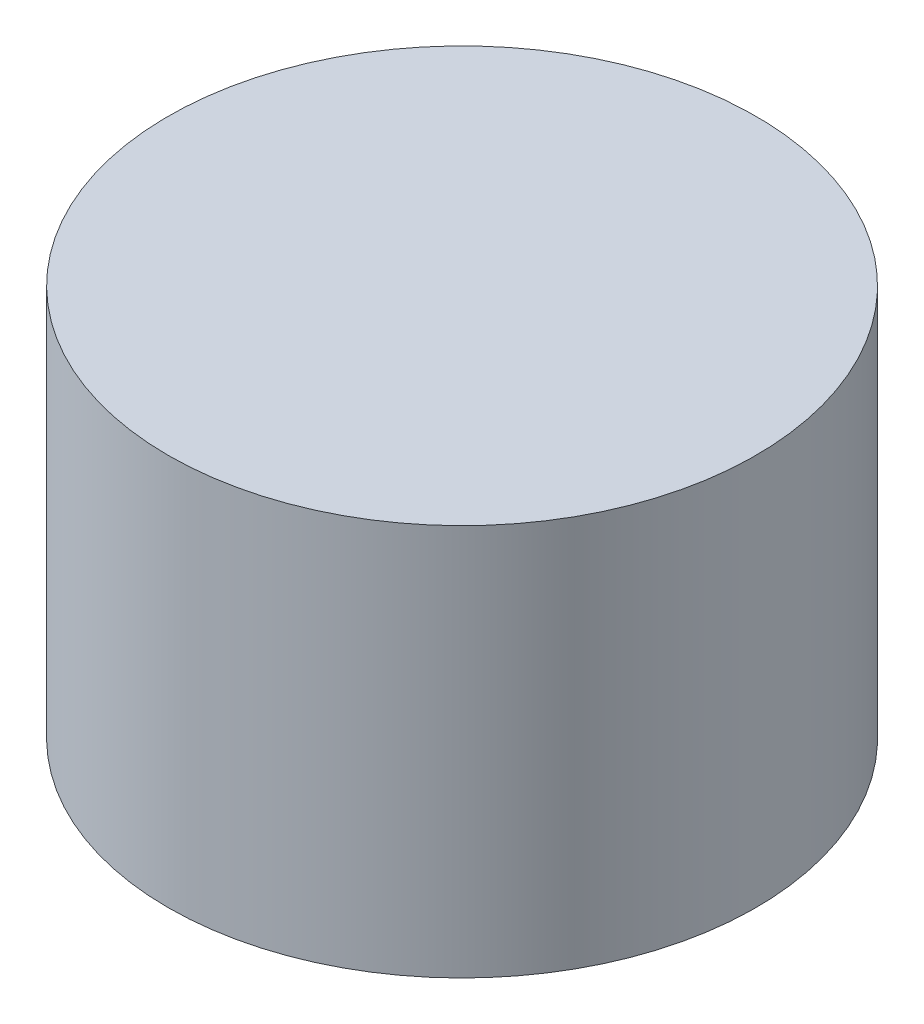
ISO-10303-21;
HEADER;
FILE_DESCRIPTION(('STEP AP214'),'2;1');
FILE_NAME('part.step','',(''),(''),'','','');
FILE_SCHEMA(('AUTOMOTIVE_DESIGN { 1 0 10303 214 1 1 1 1 }'));
ENDSEC;
DATA;
#1=APPLICATION_CONTEXT('core data for automotive mechanical design processes');
#2=APPLICATION_PROTOCOL_DEFINITION('international standard','automotive_design',2000,#1);
#3=PRODUCT_CONTEXT('',#1,'mechanical');
#4=PRODUCT('Part','Part','',(#3));
#5=PRODUCT_RELATED_PRODUCT_CATEGORY('part','',(#4));
#6=PRODUCT_DEFINITION_FORMATION('','',#4);
#7=PRODUCT_DEFINITION_CONTEXT('part definition',#1,'design');
#8=PRODUCT_DEFINITION('design','',#6,#7);
#9=PRODUCT_DEFINITION_SHAPE('','',#8);
#10=(LENGTH_UNIT() NAMED_UNIT(*) SI_UNIT(.MILLI.,.METRE.));
#11=(NAMED_UNIT(*) PLANE_ANGLE_UNIT() SI_UNIT($,.RADIAN.));
#12=(NAMED_UNIT(*) SI_UNIT($,.STERADIAN.) SOLID_ANGLE_UNIT());
#13=UNCERTAINTY_MEASURE_WITH_UNIT(LENGTH_MEASURE(1.E-05),#10,'distance_accuracy_value','');
#14=(GEOMETRIC_REPRESENTATION_CONTEXT(3) GLOBAL_UNCERTAINTY_ASSIGNED_CONTEXT((#13)) GLOBAL_UNIT_ASSIGNED_CONTEXT((#10,
#11,#12)) REPRESENTATION_CONTEXT('',''));
#15=CARTESIAN_POINT('',(0.,0.,0.));
#16=DIRECTION('',(0.,0.,1.));
#17=DIRECTION('',(1.,0.,0.));
#18=AXIS2_PLACEMENT_3D('',#15,#16,#17);
#19=CARTESIAN_POINT('',(0.,2.,0.));
#20=DIRECTION('',(0.,-1.,0.));
#21=DIRECTION('',(0.,0.,-1.));
#22=AXIS2_PLACEMENT_3D('',#19,#20,#21);
#23=CYLINDRICAL_SURFACE('',#22,1.5);
#24=CARTESIAN_POINT('',(0.,2.,0.));
#25=DIRECTION('',(0.,1.,0.));
#26=DIRECTION('',(0.,0.,1.));
#27=AXIS2_PLACEMENT_3D('',#24,#25,#26);
#28=CIRCLE('',#27,1.5);
#29=CARTESIAN_POINT('',(0.,2.,1.5));
#30=VERTEX_POINT('',#29);
#31=EDGE_CURVE('E10',#30,#30,#28,.T.);
#32=ORIENTED_EDGE('',*,*,#31,.F.);
#33=EDGE_LOOP('',(#32));
#34=FACE_BOUND('',#33,.T.);
#35=CARTESIAN_POINT('',(0.,0.,0.));
#36=DIRECTION('',(0.,1.,0.));
#37=DIRECTION('',(0.,0.,1.));
#38=AXIS2_PLACEMENT_3D('',#35,#36,#37);
#39=CIRCLE('',#38,1.5);
#40=CARTESIAN_POINT('',(0.,0.,1.5));
#41=VERTEX_POINT('',#40);
#42=EDGE_CURVE('E35',#41,#41,#39,.T.);
#43=ORIENTED_EDGE('',*,*,#42,.T.);
#44=EDGE_LOOP('',(#43));
#45=FACE_BOUND('',#44,.T.);
#46=ADVANCED_FACE('F32',(#34,#45),#23,.T.);
#47=CARTESIAN_POINT('',(0.,2.,0.));
#48=DIRECTION('',(0.,1.,0.));
#49=DIRECTION('',(0.,0.,1.));
#50=AXIS2_PLACEMENT_3D('',#47,#48,#49);
#51=PLANE('',#50);
#52=ORIENTED_EDGE('',*,*,#31,.T.);
#53=EDGE_LOOP('',(#52));
#54=FACE_BOUND('',#53,.T.);
#55=ADVANCED_FACE('F47',(#54),#51,.T.);
#56=CARTESIAN_POINT('',(0.,0.,0.));
#57=DIRECTION('',(0.,1.,0.));
#58=DIRECTION('',(0.,0.,1.));
#59=AXIS2_PLACEMENT_3D('',#56,#57,#58);
#60=PLANE('',#59);
#61=ORIENTED_EDGE('',*,*,#42,.F.);
#62=EDGE_LOOP('',(#61));
#63=FACE_BOUND('',#62,.T.);
#64=ADVANCED_FACE('F45',(#63),#60,.F.);
#65=CLOSED_SHELL('',(#46,#55,#64));
#66=MANIFOLD_SOLID_BREP('B2',#65);
#67=ADVANCED_BREP_SHAPE_REPRESENTATION('',(#18,#66),#14);
#68=SHAPE_DEFINITION_REPRESENTATION(#9,#67);
ENDSEC;
END-ISO-10303-21;
